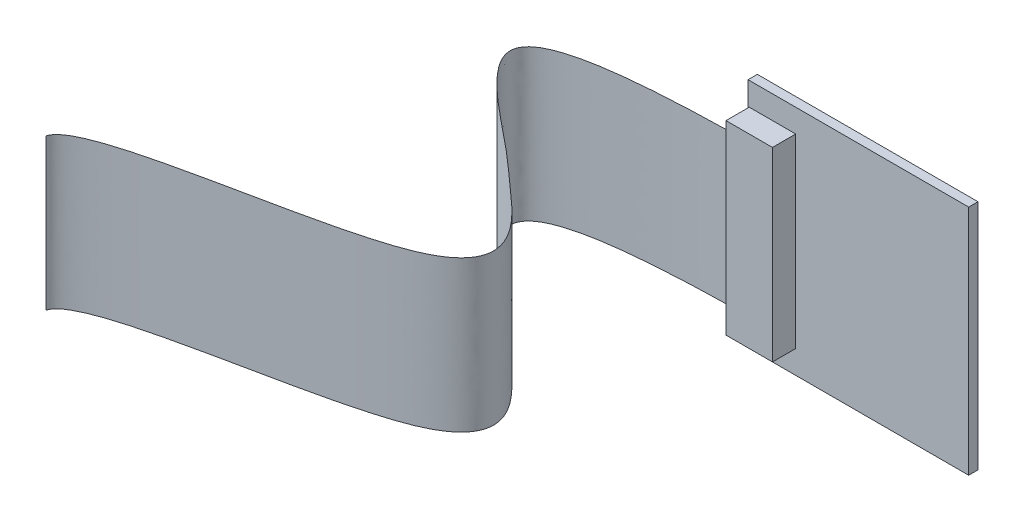
ISO-10303-21;
HEADER;
FILE_DESCRIPTION(('STEP AP214'),'2;1');
FILE_NAME('part.step','',(''),(''),'','','');
FILE_SCHEMA(('AUTOMOTIVE_DESIGN { 1 0 10303 214 1 1 1 1 }'));
ENDSEC;
DATA;
#1=APPLICATION_CONTEXT('core data for automotive mechanical design processes');
#2=APPLICATION_PROTOCOL_DEFINITION('international standard','automotive_design',2000,#1);
#3=PRODUCT_CONTEXT('',#1,'mechanical');
#4=PRODUCT('Part','Part','',(#3));
#5=PRODUCT_RELATED_PRODUCT_CATEGORY('part','',(#4));
#6=PRODUCT_DEFINITION_FORMATION('','',#4);
#7=PRODUCT_DEFINITION_CONTEXT('part definition',#1,'design');
#8=PRODUCT_DEFINITION('design','',#6,#7);
#9=PRODUCT_DEFINITION_SHAPE('','',#8);
#10=(LENGTH_UNIT() NAMED_UNIT(*) SI_UNIT(.MILLI.,.METRE.));
#11=(NAMED_UNIT(*) PLANE_ANGLE_UNIT() SI_UNIT($,.RADIAN.));
#12=(NAMED_UNIT(*) SI_UNIT($,.STERADIAN.) SOLID_ANGLE_UNIT());
#13=UNCERTAINTY_MEASURE_WITH_UNIT(LENGTH_MEASURE(1.E-05),#10,'distance_accuracy_value','');
#14=(GEOMETRIC_REPRESENTATION_CONTEXT(3) GLOBAL_UNCERTAINTY_ASSIGNED_CONTEXT((#13)) GLOBAL_UNIT_ASSIGNED_CONTEXT((#10,
#11,#12)) REPRESENTATION_CONTEXT('',''));
#15=CARTESIAN_POINT('',(0.,0.,0.));
#16=DIRECTION('',(0.,0.,1.));
#17=DIRECTION('',(1.,0.,0.));
#18=AXIS2_PLACEMENT_3D('',#15,#16,#17);
#19=CARTESIAN_POINT('',(-11.938,8.255,2.45605742360766));
#20=CARTESIAN_POINT('',(-26.1758115496553,8.25499999999999,2.7258120791372));
#21=CARTESIAN_POINT('',(-37.6882423557233,8.255,4.92049113556045));
#22=CARTESIAN_POINT('',(-22.2331655861221,8.255,16.9635984039045));
#23=CARTESIAN_POINT('',(-19.8035569788277,8.255,19.5802135380439));
#24=CARTESIAN_POINT('',(-4.17631687773087,8.25500000000001,32.427150880711));
#25=CARTESIAN_POINT('',(-48.6542484808318,8.25499999999999,36.5242201029776));
#26=CARTESIAN_POINT('',(-49.5684735341426,8.255,40.2877833623454));
#27=B_SPLINE_CURVE_WITH_KNOTS('',3,(#19,#20,#21,#22,#23,#24,#25,#26),.UNSPECIFIED.,.F.,.F.,(4,1,
1,1,1,4),(0.,0.183080416841536,0.309256257853657,0.468445882849662,0.731342284539596,1.),.UNSPECIFIED.);
#28=DIRECTION('',(0.,-1.,0.));
#29=VECTOR('',#28,1.);
#30=SURFACE_OF_LINEAR_EXTRUSION('',#27,#29);
#31=CARTESIAN_POINT('',(-11.938,-8.255,2.45605742360766));
#32=CARTESIAN_POINT('',(-26.1758115496553,-8.25500000000001,2.7258120791372));
#33=CARTESIAN_POINT('',(-37.6882423557233,-8.25500000000001,4.92049113556045));
#34=CARTESIAN_POINT('',(-22.2331655861221,-8.255,16.9635984039045));
#35=CARTESIAN_POINT('',(-19.8035569788277,-8.255,19.5802135380439));
#36=CARTESIAN_POINT('',(-4.17631687773087,-8.255,32.427150880711));
#37=CARTESIAN_POINT('',(-48.6542484808318,-8.25500000000001,36.5242201029776));
#38=CARTESIAN_POINT('',(-49.5684735341426,-8.255,40.2877833623454));
#39=B_SPLINE_CURVE_WITH_KNOTS('',3,(#31,#32,#33,#34,#35,#36,#37,#38),.UNSPECIFIED.,.F.,.F.,(4,1,
1,1,1,4),(0.,0.183080416841536,0.309256257853657,0.468445882849662,0.731342284539596,1.),.UNSPECIFIED.);
#40=CARTESIAN_POINT('',(-11.938,-8.255,2.45605742360766));
#41=VERTEX_POINT('',#40);
#42=CARTESIAN_POINT('',(-49.5684735341426,-8.255,40.2877833623454));
#43=VERTEX_POINT('',#42);
#44=EDGE_CURVE('E204',#41,#43,#39,.T.);
#45=ORIENTED_EDGE('',*,*,#44,.F.);
#46=DIRECTION('',(0.,-1.,0.));
#47=VECTOR('',#46,1.);
#48=CARTESIAN_POINT('',(-11.938,8.255,2.45605742360766));
#49=LINE('',#48,#47);
#50=CARTESIAN_POINT('',(-11.938,8.255,2.45605742360766));
#51=VERTEX_POINT('',#50);
#52=EDGE_CURVE('E186',#51,#41,#49,.T.);
#53=ORIENTED_EDGE('',*,*,#52,.F.);
#54=CARTESIAN_POINT('',(-49.5684735341426,8.255,40.2877833623454));
#55=VERTEX_POINT('',#54);
#56=EDGE_CURVE('E192',#51,#55,#27,.T.);
#57=ORIENTED_EDGE('',*,*,#56,.T.);
#58=DIRECTION('',(0.,-1.,0.));
#59=VECTOR('',#58,1.);
#60=CARTESIAN_POINT('',(-49.5684735341426,8.255,40.2877833623454));
#61=LINE('',#60,#59);
#62=EDGE_CURVE('E46',#55,#43,#61,.T.);
#63=ORIENTED_EDGE('',*,*,#62,.T.);
#64=EDGE_LOOP('',(#45,#53,#57,#63));
#65=FACE_BOUND('',#64,.T.);
#66=ADVANCED_FACE('F184',(#65),#30,.T.);
#67=OPEN_SHELL('',(#66));
#68=SHELL_BASED_SURFACE_MODEL('B6',(#67));
#69=CARTESIAN_POINT('',(-6.858,-10.16,3.556));
#70=DIRECTION('',(-1.,0.,0.));
#71=DIRECTION('',(0.,-1.,0.));
#72=AXIS2_PLACEMENT_3D('',#69,#70,#71);
#73=PLANE('',#72);
#74=DIRECTION('',(0.,1.,0.));
#75=VECTOR('',#74,1.);
#76=CARTESIAN_POINT('',(-6.858,-10.16,1.016));
#77=LINE('',#76,#75);
#78=CARTESIAN_POINT('',(-6.858,-10.16,1.016));
#79=VERTEX_POINT('',#78);
#80=CARTESIAN_POINT('',(-6.858,10.16,1.016));
#81=VERTEX_POINT('',#80);
#82=EDGE_CURVE('E311',#79,#81,#77,.T.);
#83=ORIENTED_EDGE('',*,*,#82,.T.);
#84=DIRECTION('',(0.,0.,-1.));
#85=VECTOR('',#84,1.);
#86=CARTESIAN_POINT('',(-6.858,10.16,3.556));
#87=LINE('',#86,#85);
#88=CARTESIAN_POINT('',(-6.858,10.16,3.556));
#89=VERTEX_POINT('',#88);
#90=EDGE_CURVE('E182',#89,#81,#87,.T.);
#91=ORIENTED_EDGE('',*,*,#90,.F.);
#92=DIRECTION('',(0.,1.,0.));
#93=VECTOR('',#92,1.);
#94=CARTESIAN_POINT('',(-6.858,-10.16,3.556));
#95=LINE('',#94,#93);
#96=CARTESIAN_POINT('',(-6.858,-10.16,3.556));
#97=VERTEX_POINT('',#96);
#98=EDGE_CURVE('E299',#97,#89,#95,.T.);
#99=ORIENTED_EDGE('',*,*,#98,.F.);
#100=DIRECTION('',(0.,0.,-1.));
#101=VECTOR('',#100,1.);
#102=CARTESIAN_POINT('',(-6.858,-10.16,3.556));
#103=LINE('',#102,#101);
#104=EDGE_CURVE('E307',#97,#79,#103,.T.);
#105=ORIENTED_EDGE('',*,*,#104,.T.);
#106=EDGE_LOOP('',(#83,#91,#99,#105));
#107=FACE_BOUND('',#106,.T.);
#108=ADVANCED_FACE('F248',(#107),#73,.F.);
#109=CARTESIAN_POINT('',(-11.938,10.16,3.556));
#110=DIRECTION('',(0.,-1.,0.));
#111=DIRECTION('',(0.,0.,-1.));
#112=AXIS2_PLACEMENT_3D('',#109,#110,#111);
#113=PLANE('',#112);
#114=DIRECTION('',(-1.,0.,0.));
#115=VECTOR('',#114,1.);
#116=CARTESIAN_POINT('',(-11.938,10.16,1.016));
#117=LINE('',#116,#115);
#118=CARTESIAN_POINT('',(-11.938,10.16,1.016));
#119=VERTEX_POINT('',#118);
#120=EDGE_CURVE('E303',#81,#119,#117,.T.);
#121=ORIENTED_EDGE('',*,*,#120,.T.);
#122=DIRECTION('',(0.,0.,-1.));
#123=VECTOR('',#122,1.);
#124=CARTESIAN_POINT('',(-11.938,10.16,3.556));
#125=LINE('',#124,#123);
#126=CARTESIAN_POINT('',(-11.938,10.16,3.556));
#127=VERTEX_POINT('',#126);
#128=EDGE_CURVE('E256',#127,#119,#125,.T.);
#129=ORIENTED_EDGE('',*,*,#128,.F.);
#130=DIRECTION('',(-1.,0.,0.));
#131=VECTOR('',#130,1.);
#132=CARTESIAN_POINT('',(-11.938,10.16,3.556));
#133=LINE('',#132,#131);
#134=EDGE_CURVE('E294',#89,#127,#133,.T.);
#135=ORIENTED_EDGE('',*,*,#134,.F.);
#136=ORIENTED_EDGE('',*,*,#90,.T.);
#137=EDGE_LOOP('',(#121,#129,#135,#136));
#138=FACE_BOUND('',#137,.T.);
#139=ADVANCED_FACE('F302',(#138),#113,.F.);
#140=CARTESIAN_POINT('',(-11.938,-10.16,3.556));
#141=DIRECTION('',(1.,0.,0.));
#142=DIRECTION('',(0.,1.,0.));
#143=AXIS2_PLACEMENT_3D('',#140,#141,#142);
#144=PLANE('',#143);
#145=DIRECTION('',(0.,-1.,0.));
#146=VECTOR('',#145,1.);
#147=CARTESIAN_POINT('',(-11.938,-10.16,1.016));
#148=LINE('',#147,#146);
#149=CARTESIAN_POINT('',(-11.938,-10.16,1.016));
#150=VERTEX_POINT('',#149);
#151=EDGE_CURVE('E281',#119,#150,#148,.T.);
#152=ORIENTED_EDGE('',*,*,#151,.T.);
#153=DIRECTION('',(0.,0.,-1.));
#154=VECTOR('',#153,1.);
#155=CARTESIAN_POINT('',(-11.938,-10.16,3.556));
#156=LINE('',#155,#154);
#157=CARTESIAN_POINT('',(-11.938,-10.16,3.556));
#158=VERTEX_POINT('',#157);
#159=EDGE_CURVE('E304',#158,#150,#156,.T.);
#160=ORIENTED_EDGE('',*,*,#159,.F.);
#161=DIRECTION('',(0.,-1.,0.));
#162=VECTOR('',#161,1.);
#163=CARTESIAN_POINT('',(-11.938,-10.16,3.556));
#164=LINE('',#163,#162);
#165=EDGE_CURVE('E297',#127,#158,#164,.T.);
#166=ORIENTED_EDGE('',*,*,#165,.F.);
#167=ORIENTED_EDGE('',*,*,#128,.T.);
#168=EDGE_LOOP('',(#152,#160,#166,#167));
#169=FACE_BOUND('',#168,.T.);
#170=ADVANCED_FACE('F305',(#169),#144,.F.);
#171=CARTESIAN_POINT('',(-11.938,-10.16,3.556));
#172=DIRECTION('',(0.,1.,0.));
#173=DIRECTION('',(0.,0.,1.));
#174=AXIS2_PLACEMENT_3D('',#171,#172,#173);
#175=PLANE('',#174);
#176=DIRECTION('',(1.,0.,0.));
#177=VECTOR('',#176,1.);
#178=CARTESIAN_POINT('',(-11.938,-10.16,1.016));
#179=LINE('',#178,#177);
#180=EDGE_CURVE('E287',#150,#79,#179,.T.);
#181=ORIENTED_EDGE('',*,*,#180,.T.);
#182=ORIENTED_EDGE('',*,*,#104,.F.);
#183=DIRECTION('',(1.,0.,0.));
#184=VECTOR('',#183,1.);
#185=CARTESIAN_POINT('',(-11.938,-10.16,3.556));
#186=LINE('',#185,#184);
#187=EDGE_CURVE('E264',#158,#97,#186,.T.);
#188=ORIENTED_EDGE('',*,*,#187,.F.);
#189=ORIENTED_EDGE('',*,*,#159,.T.);
#190=EDGE_LOOP('',(#181,#182,#188,#189));
#191=FACE_BOUND('',#190,.T.);
#192=ADVANCED_FACE('F318',(#191),#175,.F.);
#193=CARTESIAN_POINT('',(0.,0.,3.556));
#194=DIRECTION('',(0.,0.,-1.));
#195=DIRECTION('',(-1.,0.,0.));
#196=AXIS2_PLACEMENT_3D('',#193,#194,#195);
#197=PLANE('',#196);
#198=ORIENTED_EDGE('',*,*,#98,.T.);
#199=ORIENTED_EDGE('',*,*,#134,.T.);
#200=ORIENTED_EDGE('',*,*,#165,.T.);
#201=ORIENTED_EDGE('',*,*,#187,.T.);
#202=EDGE_LOOP('',(#198,#199,#200,#201));
#203=FACE_BOUND('',#202,.T.);
#204=ADVANCED_FACE('F295',(#203),#197,.F.);
#205=CARTESIAN_POINT('',(0.,0.,1.016));
#206=DIRECTION('',(0.,0.,-1.));
#207=DIRECTION('',(-1.,0.,0.));
#208=AXIS2_PLACEMENT_3D('',#205,#206,#207);
#209=PLANE('',#208);
#210=ORIENTED_EDGE('',*,*,#82,.F.);
#211=ORIENTED_EDGE('',*,*,#180,.F.);
#212=ORIENTED_EDGE('',*,*,#151,.F.);
#213=ORIENTED_EDGE('',*,*,#120,.F.);
#214=EDGE_LOOP('',(#210,#211,#212,#213));
#215=FACE_BOUND('',#214,.T.);
#216=ADVANCED_FACE('F321',(#215),#209,.T.);
#217=CLOSED_SHELL('',(#108,#139,#170,#192,#204,#216));
#218=MANIFOLD_SOLID_BREP('B40',#217);
#219=CARTESIAN_POINT('',(0.,0.,0.));
#220=DIRECTION('',(0.,0.,-1.));
#221=DIRECTION('',(-1.,0.,0.));
#222=AXIS2_PLACEMENT_3D('',#219,#220,#221);
#223=PLANE('',#222);
#224=DIRECTION('',(-1.,0.,0.));
#225=VECTOR('',#224,1.);
#226=CARTESIAN_POINT('',(-6.985,-3.81,0.));
#227=LINE('',#226,#225);
#228=CARTESIAN_POINT('',(0.634999999999996,-3.81,0.));
#229=VERTEX_POINT('',#228);
#230=CARTESIAN_POINT('',(-6.985,-3.81,0.));
#231=VERTEX_POINT('',#230);
#232=EDGE_CURVE('E508',#229,#231,#227,.T.);
#233=ORIENTED_EDGE('',*,*,#232,.F.);
#234=DIRECTION('',(0.,-1.,0.));
#235=VECTOR('',#234,1.);
#236=CARTESIAN_POINT('',(0.634999999999997,3.81,0.));
#237=LINE('',#236,#235);
#238=CARTESIAN_POINT('',(0.634999999999997,3.81,0.));
#239=VERTEX_POINT('',#238);
#240=EDGE_CURVE('E490',#239,#229,#237,.T.);
#241=ORIENTED_EDGE('',*,*,#240,.F.);
#242=DIRECTION('',(1.,0.,0.));
#243=VECTOR('',#242,1.);
#244=CARTESIAN_POINT('',(-6.985,3.81,0.));
#245=LINE('',#244,#243);
#246=CARTESIAN_POINT('',(-6.985,3.81,0.));
#247=VERTEX_POINT('',#246);
#248=EDGE_CURVE('E499',#247,#239,#245,.T.);
#249=ORIENTED_EDGE('',*,*,#248,.F.);
#250=DIRECTION('',(0.,1.,0.));
#251=VECTOR('',#250,1.);
#252=CARTESIAN_POINT('',(-6.985,3.81,0.));
#253=LINE('',#252,#251);
#254=EDGE_CURVE('E510',#231,#247,#253,.T.);
#255=ORIENTED_EDGE('',*,*,#254,.F.);
#256=EDGE_LOOP('',(#233,#241,#249,#255));
#257=FACE_BOUND('',#256,.T.);
#258=DIRECTION('',(0.,1.,0.));
#259=VECTOR('',#258,1.);
#260=CARTESIAN_POINT('',(12.065,-12.7,0.));
#261=LINE('',#260,#259);
#262=CARTESIAN_POINT('',(12.065,-12.7,0.));
#263=VERTEX_POINT('',#262);
#264=CARTESIAN_POINT('',(12.065,12.7,0.));
#265=VERTEX_POINT('',#264);
#266=EDGE_CURVE('E521',#263,#265,#261,.T.);
#267=ORIENTED_EDGE('',*,*,#266,.F.);
#268=DIRECTION('',(1.,0.,0.));
#269=VECTOR('',#268,1.);
#270=CARTESIAN_POINT('',(-12.065,-12.7,0.));
#271=LINE('',#270,#269);
#272=CARTESIAN_POINT('',(-12.065,-12.7,0.));
#273=VERTEX_POINT('',#272);
#274=EDGE_CURVE('E526',#273,#263,#271,.T.);
#275=ORIENTED_EDGE('',*,*,#274,.F.);
#276=DIRECTION('',(0.,-1.,0.));
#277=VECTOR('',#276,1.);
#278=CARTESIAN_POINT('',(-12.065,-12.7,0.));
#279=LINE('',#278,#277);
#280=CARTESIAN_POINT('',(-12.065,12.7,0.));
#281=VERTEX_POINT('',#280);
#282=EDGE_CURVE('E537',#281,#273,#279,.T.);
#283=ORIENTED_EDGE('',*,*,#282,.F.);
#284=DIRECTION('',(-1.,0.,0.));
#285=VECTOR('',#284,1.);
#286=CARTESIAN_POINT('',(-12.065,12.7,0.));
#287=LINE('',#286,#285);
#288=EDGE_CURVE('E535',#265,#281,#287,.T.);
#289=ORIENTED_EDGE('',*,*,#288,.F.);
#290=EDGE_LOOP('',(#267,#275,#283,#289));
#291=FACE_BOUND('',#290,.T.);
#292=DIRECTION('',(-1.,0.,0.));
#293=VECTOR('',#292,1.);
#294=CARTESIAN_POINT('',(5.46099999999999,-3.81,0.));
#295=LINE('',#294,#293);
#296=CARTESIAN_POINT('',(10.541,-3.81,0.));
#297=VERTEX_POINT('',#296);
#298=CARTESIAN_POINT('',(5.46099999999999,-3.81,0.));
#299=VERTEX_POINT('',#298);
#300=EDGE_CURVE('E746',#297,#299,#295,.T.);
#301=ORIENTED_EDGE('',*,*,#300,.F.);
#302=DIRECTION('',(0.,-1.,0.));
#303=VECTOR('',#302,1.);
#304=CARTESIAN_POINT('',(10.541,3.81,0.));
#305=LINE('',#304,#303);
#306=CARTESIAN_POINT('',(10.541,3.81,0.));
#307=VERTEX_POINT('',#306);
#308=EDGE_CURVE('E485',#307,#297,#305,.T.);
#309=ORIENTED_EDGE('',*,*,#308,.F.);
#310=DIRECTION('',(1.,0.,0.));
#311=VECTOR('',#310,1.);
#312=CARTESIAN_POINT('',(5.461,3.81,0.));
#313=LINE('',#312,#311);
#314=CARTESIAN_POINT('',(5.461,3.81,0.));
#315=VERTEX_POINT('',#314);
#316=EDGE_CURVE('E481',#315,#307,#313,.T.);
#317=ORIENTED_EDGE('',*,*,#316,.F.);
#318=DIRECTION('',(0.,1.,0.));
#319=VECTOR('',#318,1.);
#320=CARTESIAN_POINT('',(5.461,3.81,0.));
#321=LINE('',#320,#319);
#322=EDGE_CURVE('E743',#299,#315,#321,.T.);
#323=ORIENTED_EDGE('',*,*,#322,.F.);
#324=EDGE_LOOP('',(#301,#309,#317,#323));
#325=FACE_BOUND('',#324,.T.);
#326=ADVANCED_FACE('F372',(#257,#291,#325),#223,.T.);
#327=CARTESIAN_POINT('',(0.,0.,-3.81));
#328=DIRECTION('',(0.,0.,1.));
#329=DIRECTION('',(1.,0.,0.));
#330=AXIS2_PLACEMENT_3D('',#327,#328,#329);
#331=PLANE('',#330);
#332=DIRECTION('',(0.,-1.,0.));
#333=VECTOR('',#332,1.);
#334=CARTESIAN_POINT('',(0.634999999999997,3.81,-3.81));
#335=LINE('',#334,#333);
#336=CARTESIAN_POINT('',(0.634999999999997,3.81,-3.81));
#337=VERTEX_POINT('',#336);
#338=CARTESIAN_POINT('',(0.634999999999996,-3.81,-3.81));
#339=VERTEX_POINT('',#338);
#340=EDGE_CURVE('E495',#337,#339,#335,.T.);
#341=ORIENTED_EDGE('',*,*,#340,.T.);
#342=DIRECTION('',(-1.,0.,0.));
#343=VECTOR('',#342,1.);
#344=CARTESIAN_POINT('',(-6.985,-3.81,-3.81));
#345=LINE('',#344,#343);
#346=CARTESIAN_POINT('',(-6.985,-3.81,-3.81));
#347=VERTEX_POINT('',#346);
#348=EDGE_CURVE('E498',#339,#347,#345,.T.);
#349=ORIENTED_EDGE('',*,*,#348,.T.);
#350=DIRECTION('',(0.,1.,0.));
#351=VECTOR('',#350,1.);
#352=CARTESIAN_POINT('',(-6.985,3.81,-3.81));
#353=LINE('',#352,#351);
#354=CARTESIAN_POINT('',(-6.985,3.81,-3.81));
#355=VERTEX_POINT('',#354);
#356=EDGE_CURVE('E501',#347,#355,#353,.T.);
#357=ORIENTED_EDGE('',*,*,#356,.T.);
#358=DIRECTION('',(1.,0.,0.));
#359=VECTOR('',#358,1.);
#360=CARTESIAN_POINT('',(-6.985,3.81,-3.81));
#361=LINE('',#360,#359);
#362=EDGE_CURVE('E503',#355,#337,#361,.T.);
#363=ORIENTED_EDGE('',*,*,#362,.T.);
#364=EDGE_LOOP('',(#341,#349,#357,#363));
#365=FACE_BOUND('',#364,.T.);
#366=CARTESIAN_POINT('',(-3.175,0.,-3.81));
#367=DIRECTION('',(0.,0.,1.));
#368=DIRECTION('',(1.,0.,0.));
#369=AXIS2_PLACEMENT_3D('',#366,#367,#368);
#370=CIRCLE('',#369,3.7465);
#371=CARTESIAN_POINT('',(0.571499999999996,0.,-3.81));
#372=VERTEX_POINT('',#371);
#373=EDGE_CURVE('E246',#372,#372,#370,.F.);
#374=ORIENTED_EDGE('',*,*,#373,.F.);
#375=EDGE_LOOP('',(#374));
#376=FACE_BOUND('',#375,.T.);
#377=ADVANCED_FACE('F582',(#365,#376),#331,.F.);
#378=CARTESIAN_POINT('',(12.065,-12.7,1.016));
#379=DIRECTION('',(-1.,0.,0.));
#380=DIRECTION('',(0.,0.,1.));
#381=AXIS2_PLACEMENT_3D('',#378,#379,#380);
#382=PLANE('',#381);
#383=ORIENTED_EDGE('',*,*,#266,.T.);
#384=DIRECTION('',(0.,0.,-1.));
#385=VECTOR('',#384,1.);
#386=CARTESIAN_POINT('',(12.065,12.7,1.016));
#387=LINE('',#386,#385);
#388=CARTESIAN_POINT('',(12.065,12.7,1.016));
#389=VERTEX_POINT('',#388);
#390=EDGE_CURVE('E380',#389,#265,#387,.T.);
#391=ORIENTED_EDGE('',*,*,#390,.F.);
#392=DIRECTION('',(0.,1.,0.));
#393=VECTOR('',#392,1.);
#394=CARTESIAN_POINT('',(12.065,-12.7,1.016));
#395=LINE('',#394,#393);
#396=CARTESIAN_POINT('',(12.065,-12.7,1.016));
#397=VERTEX_POINT('',#396);
#398=EDGE_CURVE('E522',#397,#389,#395,.T.);
#399=ORIENTED_EDGE('',*,*,#398,.F.);
#400=DIRECTION('',(0.,0.,-1.));
#401=VECTOR('',#400,1.);
#402=CARTESIAN_POINT('',(12.065,-12.7,1.016));
#403=LINE('',#402,#401);
#404=EDGE_CURVE('E532',#397,#263,#403,.T.);
#405=ORIENTED_EDGE('',*,*,#404,.T.);
#406=EDGE_LOOP('',(#383,#391,#399,#405));
#407=FACE_BOUND('',#406,.T.);
#408=ADVANCED_FACE('F374',(#407),#382,.F.);
#409=CARTESIAN_POINT('',(-12.065,12.7,1.016));
#410=DIRECTION('',(0.,-1.,0.));
#411=DIRECTION('',(0.,0.,-1.));
#412=AXIS2_PLACEMENT_3D('',#409,#410,#411);
#413=PLANE('',#412);
#414=ORIENTED_EDGE('',*,*,#288,.T.);
#415=DIRECTION('',(0.,0.,-1.));
#416=VECTOR('',#415,1.);
#417=CARTESIAN_POINT('',(-12.065,12.7,1.016));
#418=LINE('',#417,#416);
#419=CARTESIAN_POINT('',(-12.065,12.7,1.016));
#420=VERTEX_POINT('',#419);
#421=EDGE_CURVE('E545',#420,#281,#418,.T.);
#422=ORIENTED_EDGE('',*,*,#421,.F.);
#423=DIRECTION('',(-1.,0.,0.));
#424=VECTOR('',#423,1.);
#425=CARTESIAN_POINT('',(-12.065,12.7,1.016));
#426=LINE('',#425,#424);
#427=EDGE_CURVE('E525',#389,#420,#426,.T.);
#428=ORIENTED_EDGE('',*,*,#427,.F.);
#429=ORIENTED_EDGE('',*,*,#390,.T.);
#430=EDGE_LOOP('',(#414,#422,#428,#429));
#431=FACE_BOUND('',#430,.T.);
#432=ADVANCED_FACE('F550',(#431),#413,.F.);
#433=CARTESIAN_POINT('',(-12.065,-12.7,1.016));
#434=DIRECTION('',(1.,0.,0.));
#435=DIRECTION('',(0.,0.,-1.));
#436=AXIS2_PLACEMENT_3D('',#433,#434,#435);
#437=PLANE('',#436);
#438=ORIENTED_EDGE('',*,*,#282,.T.);
#439=DIRECTION('',(0.,0.,-1.));
#440=VECTOR('',#439,1.);
#441=CARTESIAN_POINT('',(-12.065,-12.7,1.016));
#442=LINE('',#441,#440);
#443=CARTESIAN_POINT('',(-12.065,-12.7,1.016));
#444=VERTEX_POINT('',#443);
#445=EDGE_CURVE('E542',#444,#273,#442,.T.);
#446=ORIENTED_EDGE('',*,*,#445,.F.);
#447=DIRECTION('',(0.,-1.,0.));
#448=VECTOR('',#447,1.);
#449=CARTESIAN_POINT('',(-12.065,-12.7,1.016));
#450=LINE('',#449,#448);
#451=EDGE_CURVE('E528',#420,#444,#450,.T.);
#452=ORIENTED_EDGE('',*,*,#451,.F.);
#453=ORIENTED_EDGE('',*,*,#421,.T.);
#454=EDGE_LOOP('',(#438,#446,#452,#453));
#455=FACE_BOUND('',#454,.T.);
#456=ADVANCED_FACE('F562',(#455),#437,.F.);
#457=CARTESIAN_POINT('',(-12.065,-12.7,1.016));
#458=DIRECTION('',(0.,1.,0.));
#459=DIRECTION('',(0.,0.,1.));
#460=AXIS2_PLACEMENT_3D('',#457,#458,#459);
#461=PLANE('',#460);
#462=ORIENTED_EDGE('',*,*,#274,.T.);
#463=ORIENTED_EDGE('',*,*,#404,.F.);
#464=DIRECTION('',(1.,0.,0.));
#465=VECTOR('',#464,1.);
#466=CARTESIAN_POINT('',(-12.065,-12.7,1.016));
#467=LINE('',#466,#465);
#468=EDGE_CURVE('E530',#444,#397,#467,.T.);
#469=ORIENTED_EDGE('',*,*,#468,.F.);
#470=ORIENTED_EDGE('',*,*,#445,.T.);
#471=EDGE_LOOP('',(#462,#463,#469,#470));
#472=FACE_BOUND('',#471,.T.);
#473=ADVANCED_FACE('F566',(#472),#461,.F.);
#474=CARTESIAN_POINT('',(0.,0.,1.016));
#475=DIRECTION('',(0.,0.,-1.));
#476=DIRECTION('',(-1.,0.,0.));
#477=AXIS2_PLACEMENT_3D('',#474,#475,#476);
#478=PLANE('',#477);
#479=ORIENTED_EDGE('',*,*,#398,.T.);
#480=ORIENTED_EDGE('',*,*,#427,.T.);
#481=ORIENTED_EDGE('',*,*,#451,.T.);
#482=ORIENTED_EDGE('',*,*,#468,.T.);
#483=EDGE_LOOP('',(#479,#480,#481,#482));
#484=FACE_BOUND('',#483,.T.);
#485=ADVANCED_FACE('F568',(#484),#478,.F.);
#486=CARTESIAN_POINT('',(0.634999999999997,3.81,-3.81));
#487=DIRECTION('',(-1.,0.,0.));
#488=DIRECTION('',(0.,-1.,0.));
#489=AXIS2_PLACEMENT_3D('',#486,#487,#488);
#490=PLANE('',#489);
#491=ORIENTED_EDGE('',*,*,#240,.T.);
#492=DIRECTION('',(0.,0.,1.));
#493=VECTOR('',#492,1.);
#494=CARTESIAN_POINT('',(0.634999999999996,-3.81,-3.81));
#495=LINE('',#494,#493);
#496=EDGE_CURVE('E519',#339,#229,#495,.T.);
#497=ORIENTED_EDGE('',*,*,#496,.F.);
#498=ORIENTED_EDGE('',*,*,#340,.F.);
#499=DIRECTION('',(0.,0.,1.));
#500=VECTOR('',#499,1.);
#501=CARTESIAN_POINT('',(0.634999999999997,3.81,-3.81));
#502=LINE('',#501,#500);
#503=EDGE_CURVE('E505',#337,#239,#502,.T.);
#504=ORIENTED_EDGE('',*,*,#503,.T.);
#505=EDGE_LOOP('',(#491,#497,#498,#504));
#506=FACE_BOUND('',#505,.T.);
#507=ADVANCED_FACE('F570',(#506),#490,.F.);
#508=CARTESIAN_POINT('',(-6.985,-3.81,-3.81));
#509=DIRECTION('',(0.,1.,0.));
#510=DIRECTION('',(-1.,0.,0.));
#511=AXIS2_PLACEMENT_3D('',#508,#509,#510);
#512=PLANE('',#511);
#513=ORIENTED_EDGE('',*,*,#232,.T.);
#514=DIRECTION('',(0.,0.,1.));
#515=VECTOR('',#514,1.);
#516=CARTESIAN_POINT('',(-6.985,-3.81,-3.81));
#517=LINE('',#516,#515);
#518=EDGE_CURVE('E516',#347,#231,#517,.T.);
#519=ORIENTED_EDGE('',*,*,#518,.F.);
#520=ORIENTED_EDGE('',*,*,#348,.F.);
#521=ORIENTED_EDGE('',*,*,#496,.T.);
#522=EDGE_LOOP('',(#513,#519,#520,#521));
#523=FACE_BOUND('',#522,.T.);
#524=ADVANCED_FACE('F576',(#523),#512,.F.);
#525=CARTESIAN_POINT('',(-6.985,3.81,-3.81));
#526=DIRECTION('',(1.,0.,0.));
#527=DIRECTION('',(0.,1.,0.));
#528=AXIS2_PLACEMENT_3D('',#525,#526,#527);
#529=PLANE('',#528);
#530=ORIENTED_EDGE('',*,*,#254,.T.);
#531=DIRECTION('',(0.,0.,1.));
#532=VECTOR('',#531,1.);
#533=CARTESIAN_POINT('',(-6.985,3.81,-3.81));
#534=LINE('',#533,#532);
#535=EDGE_CURVE('E395',#355,#247,#534,.T.);
#536=ORIENTED_EDGE('',*,*,#535,.F.);
#537=ORIENTED_EDGE('',*,*,#356,.F.);
#538=ORIENTED_EDGE('',*,*,#518,.T.);
#539=EDGE_LOOP('',(#530,#536,#537,#538));
#540=FACE_BOUND('',#539,.T.);
#541=ADVANCED_FACE('F681',(#540),#529,.F.);
#542=CARTESIAN_POINT('',(-6.985,3.81,-3.81));
#543=DIRECTION('',(0.,-1.,0.));
#544=DIRECTION('',(1.,0.,0.));
#545=AXIS2_PLACEMENT_3D('',#542,#543,#544);
#546=PLANE('',#545);
#547=ORIENTED_EDGE('',*,*,#248,.T.);
#548=ORIENTED_EDGE('',*,*,#503,.F.);
#549=ORIENTED_EDGE('',*,*,#362,.F.);
#550=ORIENTED_EDGE('',*,*,#535,.T.);
#551=EDGE_LOOP('',(#547,#548,#549,#550));
#552=FACE_BOUND('',#551,.T.);
#553=ADVANCED_FACE('F610',(#552),#546,.F.);
#554=CARTESIAN_POINT('',(-3.175,0.,-5.588));
#555=DIRECTION('',(0.,0.,1.));
#556=DIRECTION('',(1.,0.,0.));
#557=AXIS2_PLACEMENT_3D('',#554,#555,#556);
#558=CYLINDRICAL_SURFACE('',#557,3.7465);
#559=CARTESIAN_POINT('',(-3.175,0.,-5.588));
#560=DIRECTION('',(0.,0.,-1.));
#561=DIRECTION('',(-1.,0.,0.));
#562=AXIS2_PLACEMENT_3D('',#559,#560,#561);
#563=CIRCLE('',#562,3.7465);
#564=CARTESIAN_POINT('',(-6.9215,0.,-5.588));
#565=VERTEX_POINT('',#564);
#566=EDGE_CURVE('E487',#565,#565,#563,.T.);
#567=ORIENTED_EDGE('',*,*,#566,.F.);
#568=EDGE_LOOP('',(#567));
#569=FACE_BOUND('',#568,.T.);
#570=ORIENTED_EDGE('',*,*,#373,.T.);
#571=EDGE_LOOP('',(#570));
#572=FACE_BOUND('',#571,.T.);
#573=ADVANCED_FACE('F614',(#569,#572),#558,.T.);
#574=CARTESIAN_POINT('',(-3.175,0.,-5.588));
#575=DIRECTION('',(0.,0.,-1.));
#576=DIRECTION('',(-1.,0.,0.));
#577=AXIS2_PLACEMENT_3D('',#574,#575,#576);
#578=PLANE('',#577);
#579=ORIENTED_EDGE('',*,*,#566,.T.);
#580=EDGE_LOOP('',(#579));
#581=FACE_BOUND('',#580,.T.);
#582=ADVANCED_FACE('F618',(#581),#578,.T.);
#583=CARTESIAN_POINT('',(10.541,3.81,-1.27));
#584=DIRECTION('',(-1.,0.,0.));
#585=DIRECTION('',(0.,-1.,0.));
#586=AXIS2_PLACEMENT_3D('',#583,#584,#585);
#587=PLANE('',#586);
#588=ORIENTED_EDGE('',*,*,#308,.T.);
#589=DIRECTION('',(0.,0.,1.));
#590=VECTOR('',#589,1.);
#591=CARTESIAN_POINT('',(10.541,-3.81,-1.27));
#592=LINE('',#591,#590);
#593=CARTESIAN_POINT('',(10.541,-3.81,-1.27));
#594=VERTEX_POINT('',#593);
#595=EDGE_CURVE('E466',#594,#297,#592,.T.);
#596=ORIENTED_EDGE('',*,*,#595,.F.);
#597=DIRECTION('',(0.,-1.,0.));
#598=VECTOR('',#597,1.);
#599=CARTESIAN_POINT('',(10.541,3.81,-1.27));
#600=LINE('',#599,#598);
#601=CARTESIAN_POINT('',(10.541,3.81,-1.27));
#602=VERTEX_POINT('',#601);
#603=EDGE_CURVE('E473',#602,#594,#600,.T.);
#604=ORIENTED_EDGE('',*,*,#603,.F.);
#605=DIRECTION('',(0.,0.,1.));
#606=VECTOR('',#605,1.);
#607=CARTESIAN_POINT('',(10.541,3.81,-1.27));
#608=LINE('',#607,#606);
#609=EDGE_CURVE('E741',#602,#307,#608,.T.);
#610=ORIENTED_EDGE('',*,*,#609,.T.);
#611=EDGE_LOOP('',(#588,#596,#604,#610));
#612=FACE_BOUND('',#611,.T.);
#613=ADVANCED_FACE('F483',(#612),#587,.F.);
#614=CARTESIAN_POINT('',(5.46099999999999,-3.81,-1.27));
#615=DIRECTION('',(0.,1.,0.));
#616=DIRECTION('',(-1.,0.,0.));
#617=AXIS2_PLACEMENT_3D('',#614,#615,#616);
#618=PLANE('',#617);
#619=ORIENTED_EDGE('',*,*,#300,.T.);
#620=DIRECTION('',(0.,0.,1.));
#621=VECTOR('',#620,1.);
#622=CARTESIAN_POINT('',(5.46099999999999,-3.81,-1.27));
#623=LINE('',#622,#621);
#624=CARTESIAN_POINT('',(5.46099999999999,-3.81,-1.27));
#625=VERTEX_POINT('',#624);
#626=EDGE_CURVE('E469',#625,#299,#623,.T.);
#627=ORIENTED_EDGE('',*,*,#626,.F.);
#628=DIRECTION('',(-1.,0.,0.));
#629=VECTOR('',#628,1.);
#630=CARTESIAN_POINT('',(5.46099999999999,-3.81,-1.27));
#631=LINE('',#630,#629);
#632=EDGE_CURVE('E462',#594,#625,#631,.T.);
#633=ORIENTED_EDGE('',*,*,#632,.F.);
#634=ORIENTED_EDGE('',*,*,#595,.T.);
#635=EDGE_LOOP('',(#619,#627,#633,#634));
#636=FACE_BOUND('',#635,.T.);
#637=ADVANCED_FACE('F464',(#636),#618,.F.);
#638=CARTESIAN_POINT('',(5.461,3.81,-1.27));
#639=DIRECTION('',(1.,0.,0.));
#640=DIRECTION('',(0.,1.,0.));
#641=AXIS2_PLACEMENT_3D('',#638,#639,#640);
#642=PLANE('',#641);
#643=ORIENTED_EDGE('',*,*,#322,.T.);
#644=DIRECTION('',(0.,0.,1.));
#645=VECTOR('',#644,1.);
#646=CARTESIAN_POINT('',(5.461,3.81,-1.27));
#647=LINE('',#646,#645);
#648=CARTESIAN_POINT('',(5.461,3.81,-1.27));
#649=VERTEX_POINT('',#648);
#650=EDGE_CURVE('E387',#649,#315,#647,.T.);
#651=ORIENTED_EDGE('',*,*,#650,.F.);
#652=DIRECTION('',(0.,1.,0.));
#653=VECTOR('',#652,1.);
#654=CARTESIAN_POINT('',(5.461,3.81,-1.27));
#655=LINE('',#654,#653);
#656=EDGE_CURVE('E472',#625,#649,#655,.T.);
#657=ORIENTED_EDGE('',*,*,#656,.F.);
#658=ORIENTED_EDGE('',*,*,#626,.T.);
#659=EDGE_LOOP('',(#643,#651,#657,#658));
#660=FACE_BOUND('',#659,.T.);
#661=ADVANCED_FACE('F649',(#660),#642,.F.);
#662=CARTESIAN_POINT('',(5.461,3.81,-1.27));
#663=DIRECTION('',(0.,-1.,0.));
#664=DIRECTION('',(0.,0.,-1.));
#665=AXIS2_PLACEMENT_3D('',#662,#663,#664);
#666=PLANE('',#665);
#667=ORIENTED_EDGE('',*,*,#316,.T.);
#668=ORIENTED_EDGE('',*,*,#609,.F.);
#669=DIRECTION('',(1.,0.,0.));
#670=VECTOR('',#669,1.);
#671=CARTESIAN_POINT('',(5.461,3.81,-1.27));
#672=LINE('',#671,#670);
#673=EDGE_CURVE('E477',#649,#602,#672,.T.);
#674=ORIENTED_EDGE('',*,*,#673,.F.);
#675=ORIENTED_EDGE('',*,*,#650,.T.);
#676=EDGE_LOOP('',(#667,#668,#674,#675));
#677=FACE_BOUND('',#676,.T.);
#678=ADVANCED_FACE('F658',(#677),#666,.F.);
#679=CARTESIAN_POINT('',(0.,0.,-1.27));
#680=DIRECTION('',(0.,0.,1.));
#681=DIRECTION('',(1.,0.,0.));
#682=AXIS2_PLACEMENT_3D('',#679,#680,#681);
#683=PLANE('',#682);
#684=ORIENTED_EDGE('',*,*,#603,.T.);
#685=ORIENTED_EDGE('',*,*,#632,.T.);
#686=ORIENTED_EDGE('',*,*,#656,.T.);
#687=ORIENTED_EDGE('',*,*,#673,.T.);
#688=EDGE_LOOP('',(#684,#685,#686,#687));
#689=FACE_BOUND('',#688,.T.);
#690=ADVANCED_FACE('F476',(#689),#683,.F.);
#691=CLOSED_SHELL('',(#326,#377,#408,#432,#456,#473,#485,#507,#524,#541,#553,#573,#582,#613,
#637,#661,#678,#690));
#692=MANIFOLD_SOLID_BREP('B176',#691);
#693=ADVANCED_BREP_SHAPE_REPRESENTATION('',(#18,#218,#692),#14);
#694=MANIFOLD_SURFACE_SHAPE_REPRESENTATION('',(#18,#68),#14);
#695=SHAPE_REPRESENTATION('',(#18),#14);
#696=SHAPE_DEFINITION_REPRESENTATION(#9,#695);
#697=SHAPE_REPRESENTATION_RELATIONSHIP('','',#695,#693);
#698=SHAPE_REPRESENTATION_RELATIONSHIP('','',#695,#694);
ENDSEC;
END-ISO-10303-21;
